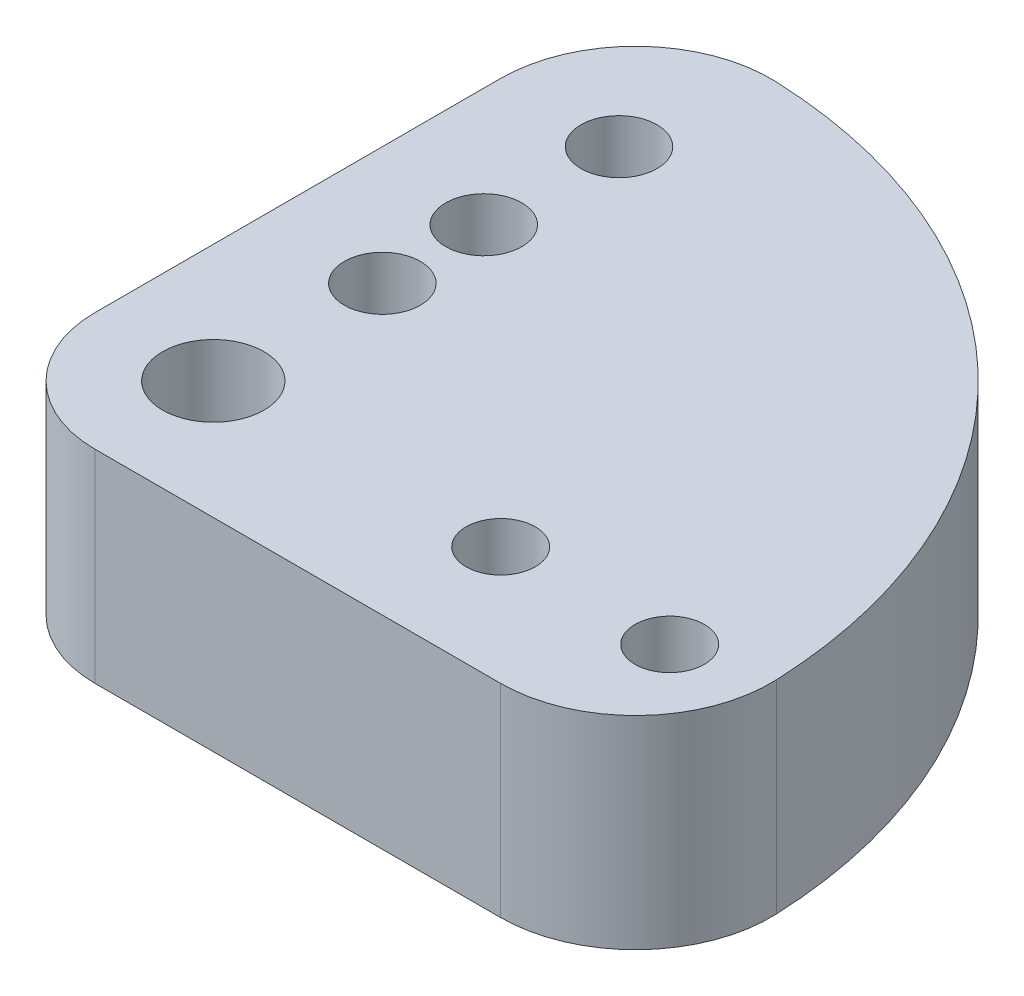
ISO-10303-21;
HEADER;
FILE_DESCRIPTION(('STEP AP214'),'2;1');
FILE_NAME('part.step','',(''),(''),'','','');
FILE_SCHEMA(('AUTOMOTIVE_DESIGN { 1 0 10303 214 1 1 1 1 }'));
ENDSEC;
DATA;
#1=APPLICATION_CONTEXT('core data for automotive mechanical design processes');
#2=APPLICATION_PROTOCOL_DEFINITION('international standard','automotive_design',2000,#1);
#3=PRODUCT_CONTEXT('',#1,'mechanical');
#4=PRODUCT('Part','Part','',(#3));
#5=PRODUCT_RELATED_PRODUCT_CATEGORY('part','',(#4));
#6=PRODUCT_DEFINITION_FORMATION('','',#4);
#7=PRODUCT_DEFINITION_CONTEXT('part definition',#1,'design');
#8=PRODUCT_DEFINITION('design','',#6,#7);
#9=PRODUCT_DEFINITION_SHAPE('','',#8);
#10=(LENGTH_UNIT() NAMED_UNIT(*) SI_UNIT(.MILLI.,.METRE.));
#11=(NAMED_UNIT(*) PLANE_ANGLE_UNIT() SI_UNIT($,.RADIAN.));
#12=(NAMED_UNIT(*) SI_UNIT($,.STERADIAN.) SOLID_ANGLE_UNIT());
#13=UNCERTAINTY_MEASURE_WITH_UNIT(LENGTH_MEASURE(1.E-05),#10,'distance_accuracy_value','');
#14=(GEOMETRIC_REPRESENTATION_CONTEXT(3) GLOBAL_UNCERTAINTY_ASSIGNED_CONTEXT((#13)) GLOBAL_UNIT_ASSIGNED_CONTEXT((#10,
#11,#12)) REPRESENTATION_CONTEXT('',''));
#15=CARTESIAN_POINT('',(0.,0.,0.));
#16=DIRECTION('',(0.,0.,1.));
#17=DIRECTION('',(1.,0.,0.));
#18=AXIS2_PLACEMENT_3D('',#15,#16,#17);
#19=CARTESIAN_POINT('',(0.,6.,0.));
#20=DIRECTION('',(0.,-1.,0.));
#21=DIRECTION('',(0.,0.,-1.));
#22=AXIS2_PLACEMENT_3D('',#19,#20,#21);
#23=CYLINDRICAL_SURFACE('',#22,1.5);
#24=CARTESIAN_POINT('',(0.,6.,0.));
#25=DIRECTION('',(0.,1.,0.));
#26=DIRECTION('',(0.,0.,1.));
#27=AXIS2_PLACEMENT_3D('',#24,#25,#26);
#28=CIRCLE('',#27,1.5);
#29=CARTESIAN_POINT('',(0.,6.,1.5));
#30=VERTEX_POINT('',#29);
#31=EDGE_CURVE('E214',#30,#30,#28,.T.);
#32=ORIENTED_EDGE('',*,*,#31,.T.);
#33=EDGE_LOOP('',(#32));
#34=FACE_BOUND('',#33,.T.);
#35=CARTESIAN_POINT('',(0.,3.,0.));
#36=DIRECTION('',(0.,-1.,0.));
#37=DIRECTION('',(0.,0.,-1.));
#38=AXIS2_PLACEMENT_3D('',#35,#36,#37);
#39=CIRCLE('',#38,1.5);
#40=CARTESIAN_POINT('',(0.,3.,-1.5));
#41=VERTEX_POINT('',#40);
#42=EDGE_CURVE('E132',#41,#41,#39,.T.);
#43=ORIENTED_EDGE('',*,*,#42,.T.);
#44=EDGE_LOOP('',(#43));
#45=FACE_BOUND('',#44,.T.);
#46=ADVANCED_FACE('F39',(#34,#45),#23,.F.);
#47=CARTESIAN_POINT('',(0.,6.,0.));
#48=DIRECTION('',(0.,1.,0.));
#49=DIRECTION('',(0.,0.,1.));
#50=AXIS2_PLACEMENT_3D('',#47,#48,#49);
#51=PLANE('',#50);
#52=CARTESIAN_POINT('',(0.,6.,-8.));
#53=DIRECTION('',(0.,1.,0.));
#54=DIRECTION('',(0.,0.,1.));
#55=AXIS2_PLACEMENT_3D('',#52,#53,#54);
#56=CIRCLE('',#55,1.125);
#57=CARTESIAN_POINT('',(0.,6.,-6.875));
#58=VERTEX_POINT('',#57);
#59=EDGE_CURVE('E205',#58,#58,#56,.T.);
#60=ORIENTED_EDGE('',*,*,#59,.F.);
#61=EDGE_LOOP('',(#60));
#62=FACE_BOUND('',#61,.T.);
#63=ORIENTED_EDGE('',*,*,#31,.F.);
#64=EDGE_LOOP('',(#63));
#65=FACE_BOUND('',#64,.T.);
#66=CARTESIAN_POINT('',(8.5,6.,0.));
#67=DIRECTION('',(0.,1.,0.));
#68=DIRECTION('',(0.,0.,1.));
#69=AXIS2_PLACEMENT_3D('',#66,#67,#68);
#70=CIRCLE('',#69,1.025);
#71=CARTESIAN_POINT('',(8.5,6.,1.025));
#72=VERTEX_POINT('',#71);
#73=EDGE_CURVE('E125',#72,#72,#70,.T.);
#74=ORIENTED_EDGE('',*,*,#73,.F.);
#75=EDGE_LOOP('',(#74));
#76=FACE_BOUND('',#75,.T.);
#77=CARTESIAN_POINT('',(0.,6.,0.));
#78=DIRECTION('',(0.,1.,0.));
#79=DIRECTION('',(0.,0.,1.));
#80=AXIS2_PLACEMENT_3D('',#77,#78,#79);
#81=CIRCLE('',#80,16.);
#82=CARTESIAN_POINT('',(15.9861050777091,6.,-0.666666666666667));
#83=VERTEX_POINT('',#82);
#84=CARTESIAN_POINT('',(0.666666666666607,6.,-15.9861050777091));
#85=VERTEX_POINT('',#84);
#86=EDGE_CURVE('E104',#83,#85,#81,.T.);
#87=ORIENTED_EDGE('',*,*,#86,.T.);
#88=CARTESIAN_POINT('',(0.499999999999955,6.,-11.9895788082818));
#89=DIRECTION('',(0.,1.,0.));
#90=DIRECTION('',(0.,0.,1.));
#91=AXIS2_PLACEMENT_3D('',#88,#89,#90);
#92=CIRCLE('',#91,4.);
#93=CARTESIAN_POINT('',(-3.50000000000005,6.,-11.9895788082818));
#94=VERTEX_POINT('',#93);
#95=EDGE_CURVE('E47',#85,#94,#92,.T.);
#96=ORIENTED_EDGE('',*,*,#95,.T.);
#97=DIRECTION('',(0.,0.,1.));
#98=VECTOR('',#97,1.);
#99=CARTESIAN_POINT('',(-3.5,6.,0.));
#100=LINE('',#99,#98);
#101=CARTESIAN_POINT('',(-3.5,6.,0.));
#102=VERTEX_POINT('',#101);
#103=EDGE_CURVE('E93',#94,#102,#100,.T.);
#104=ORIENTED_EDGE('',*,*,#103,.T.);
#105=CARTESIAN_POINT('',(0.,6.,0.));
#106=DIRECTION('',(0.,1.,0.));
#107=DIRECTION('',(0.,0.,1.));
#108=AXIS2_PLACEMENT_3D('',#105,#106,#107);
#109=CIRCLE('',#108,3.5);
#110=CARTESIAN_POINT('',(0.,6.,3.5));
#111=VERTEX_POINT('',#110);
#112=EDGE_CURVE('E98',#102,#111,#109,.T.);
#113=ORIENTED_EDGE('',*,*,#112,.T.);
#114=DIRECTION('',(1.,0.,0.));
#115=VECTOR('',#114,1.);
#116=CARTESIAN_POINT('',(0.,6.,3.5));
#117=LINE('',#116,#115);
#118=CARTESIAN_POINT('',(11.9895788082818,6.,3.5));
#119=VERTEX_POINT('',#118);
#120=EDGE_CURVE('E118',#111,#119,#117,.T.);
#121=ORIENTED_EDGE('',*,*,#120,.T.);
#122=CARTESIAN_POINT('',(11.9895788082818,6.,-0.5));
#123=DIRECTION('',(0.,1.,0.));
#124=DIRECTION('',(0.,0.,1.));
#125=AXIS2_PLACEMENT_3D('',#122,#123,#124);
#126=CIRCLE('',#125,4.);
#127=EDGE_CURVE('E146',#119,#83,#126,.T.);
#128=ORIENTED_EDGE('',*,*,#127,.T.);
#129=EDGE_LOOP('',(#87,#96,#104,#113,#121,#128));
#130=FACE_BOUND('',#129,.T.);
#131=CARTESIAN_POINT('',(13.5,6.,0.));
#132=DIRECTION('',(0.,1.,0.));
#133=DIRECTION('',(0.,0.,1.));
#134=AXIS2_PLACEMENT_3D('',#131,#132,#133);
#135=CIRCLE('',#134,1.025);
#136=CARTESIAN_POINT('',(13.5,6.,1.025));
#137=VERTEX_POINT('',#136);
#138=EDGE_CURVE('E219',#137,#137,#135,.T.);
#139=ORIENTED_EDGE('',*,*,#138,.F.);
#140=EDGE_LOOP('',(#139));
#141=FACE_BOUND('',#140,.T.);
#142=CARTESIAN_POINT('',(0.,6.,-12.));
#143=DIRECTION('',(0.,1.,0.));
#144=DIRECTION('',(0.,0.,1.));
#145=AXIS2_PLACEMENT_3D('',#142,#143,#144);
#146=CIRCLE('',#145,1.125);
#147=CARTESIAN_POINT('',(0.,6.,-10.875));
#148=VERTEX_POINT('',#147);
#149=EDGE_CURVE('E211',#148,#148,#146,.T.);
#150=ORIENTED_EDGE('',*,*,#149,.F.);
#151=EDGE_LOOP('',(#150));
#152=FACE_BOUND('',#151,.T.);
#153=CARTESIAN_POINT('',(0.,6.,-5.));
#154=DIRECTION('',(0.,1.,0.));
#155=DIRECTION('',(0.,0.,1.));
#156=AXIS2_PLACEMENT_3D('',#153,#154,#155);
#157=CIRCLE('',#156,1.125);
#158=CARTESIAN_POINT('',(0.,6.,-3.875));
#159=VERTEX_POINT('',#158);
#160=EDGE_CURVE('E199',#159,#159,#157,.T.);
#161=ORIENTED_EDGE('',*,*,#160,.F.);
#162=EDGE_LOOP('',(#161));
#163=FACE_BOUND('',#162,.T.);
#164=ADVANCED_FACE('F95',(#62,#65,#76,#130,#141,#152,#163),#51,.T.);
#165=CARTESIAN_POINT('',(0.,0.,0.));
#166=DIRECTION('',(0.,1.,0.));
#167=DIRECTION('',(0.,0.,1.));
#168=AXIS2_PLACEMENT_3D('',#165,#166,#167);
#169=PLANE('',#168);
#170=CARTESIAN_POINT('',(0.,0.,0.));
#171=DIRECTION('',(0.,-1.,0.));
#172=DIRECTION('',(0.,0.,-1.));
#173=AXIS2_PLACEMENT_3D('',#170,#171,#172);
#174=CIRCLE('',#173,2.5);
#175=CARTESIAN_POINT('',(0.,0.,-2.5));
#176=VERTEX_POINT('',#175);
#177=EDGE_CURVE('E193',#176,#176,#174,.T.);
#178=ORIENTED_EDGE('',*,*,#177,.F.);
#179=EDGE_LOOP('',(#178));
#180=FACE_BOUND('',#179,.T.);
#181=DIRECTION('',(0.,0.,1.));
#182=VECTOR('',#181,1.);
#183=CARTESIAN_POINT('',(-3.5,0.,0.));
#184=LINE('',#183,#182);
#185=CARTESIAN_POINT('',(-3.50000000000005,0.,-11.9895788082818));
#186=VERTEX_POINT('',#185);
#187=CARTESIAN_POINT('',(-3.5,0.,0.));
#188=VERTEX_POINT('',#187);
#189=EDGE_CURVE('E110',#186,#188,#184,.T.);
#190=ORIENTED_EDGE('',*,*,#189,.F.);
#191=CARTESIAN_POINT('',(0.499999999999955,0.,-11.9895788082818));
#192=DIRECTION('',(0.,1.,0.));
#193=DIRECTION('',(0.,0.,1.));
#194=AXIS2_PLACEMENT_3D('',#191,#192,#193);
#195=CIRCLE('',#194,4.);
#196=CARTESIAN_POINT('',(0.666666666666607,0.,-15.9861050777091));
#197=VERTEX_POINT('',#196);
#198=EDGE_CURVE('E140',#186,#197,#195,.F.);
#199=ORIENTED_EDGE('',*,*,#198,.T.);
#200=CARTESIAN_POINT('',(0.,0.,0.));
#201=DIRECTION('',(0.,1.,0.));
#202=DIRECTION('',(0.,0.,1.));
#203=AXIS2_PLACEMENT_3D('',#200,#201,#202);
#204=CIRCLE('',#203,16.);
#205=CARTESIAN_POINT('',(15.9861050777091,0.,-0.666666666666667));
#206=VERTEX_POINT('',#205);
#207=EDGE_CURVE('E123',#206,#197,#204,.T.);
#208=ORIENTED_EDGE('',*,*,#207,.F.);
#209=CARTESIAN_POINT('',(11.9895788082818,0.,-0.5));
#210=DIRECTION('',(0.,1.,0.));
#211=DIRECTION('',(0.,0.,1.));
#212=AXIS2_PLACEMENT_3D('',#209,#210,#211);
#213=CIRCLE('',#212,4.);
#214=CARTESIAN_POINT('',(11.9895788082818,0.,3.5));
#215=VERTEX_POINT('',#214);
#216=EDGE_CURVE('E138',#206,#215,#213,.F.);
#217=ORIENTED_EDGE('',*,*,#216,.T.);
#218=DIRECTION('',(1.,0.,0.));
#219=VECTOR('',#218,1.);
#220=CARTESIAN_POINT('',(0.,0.,3.5));
#221=LINE('',#220,#219);
#222=CARTESIAN_POINT('',(0.,0.,3.5));
#223=VERTEX_POINT('',#222);
#224=EDGE_CURVE('E129',#223,#215,#221,.T.);
#225=ORIENTED_EDGE('',*,*,#224,.F.);
#226=CARTESIAN_POINT('',(0.,0.,0.));
#227=DIRECTION('',(0.,1.,0.));
#228=DIRECTION('',(0.,0.,1.));
#229=AXIS2_PLACEMENT_3D('',#226,#227,#228);
#230=CIRCLE('',#229,3.5);
#231=EDGE_CURVE('E127',#188,#223,#230,.T.);
#232=ORIENTED_EDGE('',*,*,#231,.F.);
#233=EDGE_LOOP('',(#190,#199,#208,#217,#225,#232));
#234=FACE_BOUND('',#233,.T.);
#235=CARTESIAN_POINT('',(8.5,0.,0.));
#236=DIRECTION('',(0.,1.,0.));
#237=DIRECTION('',(0.,0.,1.));
#238=AXIS2_PLACEMENT_3D('',#235,#236,#237);
#239=CIRCLE('',#238,1.025);
#240=CARTESIAN_POINT('',(8.5,0.,1.025));
#241=VERTEX_POINT('',#240);
#242=EDGE_CURVE('E222',#241,#241,#239,.T.);
#243=ORIENTED_EDGE('',*,*,#242,.T.);
#244=EDGE_LOOP('',(#243));
#245=FACE_BOUND('',#244,.T.);
#246=CARTESIAN_POINT('',(13.5,0.,0.));
#247=DIRECTION('',(0.,1.,0.));
#248=DIRECTION('',(0.,0.,1.));
#249=AXIS2_PLACEMENT_3D('',#246,#247,#248);
#250=CIRCLE('',#249,1.025);
#251=CARTESIAN_POINT('',(13.5,0.,1.025));
#252=VERTEX_POINT('',#251);
#253=EDGE_CURVE('E218',#252,#252,#250,.T.);
#254=ORIENTED_EDGE('',*,*,#253,.T.);
#255=EDGE_LOOP('',(#254));
#256=FACE_BOUND('',#255,.T.);
#257=CARTESIAN_POINT('',(0.,0.,-12.));
#258=DIRECTION('',(0.,1.,0.));
#259=DIRECTION('',(0.,0.,1.));
#260=AXIS2_PLACEMENT_3D('',#257,#258,#259);
#261=CIRCLE('',#260,1.125);
#262=CARTESIAN_POINT('',(0.,0.,-10.875));
#263=VERTEX_POINT('',#262);
#264=EDGE_CURVE('E208',#263,#263,#261,.T.);
#265=ORIENTED_EDGE('',*,*,#264,.T.);
#266=EDGE_LOOP('',(#265));
#267=FACE_BOUND('',#266,.T.);
#268=CARTESIAN_POINT('',(0.,0.,-8.));
#269=DIRECTION('',(0.,1.,0.));
#270=DIRECTION('',(0.,0.,1.));
#271=AXIS2_PLACEMENT_3D('',#268,#269,#270);
#272=CIRCLE('',#271,1.125);
#273=CARTESIAN_POINT('',(0.,0.,-6.875));
#274=VERTEX_POINT('',#273);
#275=EDGE_CURVE('E202',#274,#274,#272,.T.);
#276=ORIENTED_EDGE('',*,*,#275,.T.);
#277=EDGE_LOOP('',(#276));
#278=FACE_BOUND('',#277,.T.);
#279=CARTESIAN_POINT('',(0.,0.,-5.));
#280=DIRECTION('',(0.,1.,0.));
#281=DIRECTION('',(0.,0.,1.));
#282=AXIS2_PLACEMENT_3D('',#279,#280,#281);
#283=CIRCLE('',#282,1.125);
#284=CARTESIAN_POINT('',(0.,0.,-3.875));
#285=VERTEX_POINT('',#284);
#286=EDGE_CURVE('E135',#285,#285,#283,.T.);
#287=ORIENTED_EDGE('',*,*,#286,.T.);
#288=EDGE_LOOP('',(#287));
#289=FACE_BOUND('',#288,.T.);
#290=ADVANCED_FACE('F154',(#180,#234,#245,#256,#267,#278,#289),#169,.F.);
#291=CARTESIAN_POINT('',(0.,6.,0.));
#292=DIRECTION('',(0.,-1.,0.));
#293=DIRECTION('',(0.,0.,-1.));
#294=AXIS2_PLACEMENT_3D('',#291,#292,#293);
#295=CYLINDRICAL_SURFACE('',#294,16.);
#296=ORIENTED_EDGE('',*,*,#207,.T.);
#297=DIRECTION('',(0.,-1.,0.));
#298=VECTOR('',#297,1.);
#299=CARTESIAN_POINT('',(0.666666666666607,6.,-15.9861050777091));
#300=LINE('',#299,#298);
#301=EDGE_CURVE('E60',#197,#85,#300,.F.);
#302=ORIENTED_EDGE('',*,*,#301,.T.);
#303=ORIENTED_EDGE('',*,*,#86,.F.);
#304=DIRECTION('',(0.,-1.,0.));
#305=VECTOR('',#304,1.);
#306=CARTESIAN_POINT('',(15.9861050777091,6.,-0.666666666666667));
#307=LINE('',#306,#305);
#308=EDGE_CURVE('E142',#83,#206,#307,.T.);
#309=ORIENTED_EDGE('',*,*,#308,.T.);
#310=EDGE_LOOP('',(#296,#302,#303,#309));
#311=FACE_BOUND('',#310,.T.);
#312=ADVANCED_FACE('F150',(#311),#295,.T.);
#313=CARTESIAN_POINT('',(-3.5,6.,0.));
#314=DIRECTION('',(1.,0.,0.));
#315=DIRECTION('',(0.,0.,-1.));
#316=AXIS2_PLACEMENT_3D('',#313,#314,#315);
#317=PLANE('',#316);
#318=ORIENTED_EDGE('',*,*,#103,.F.);
#319=DIRECTION('',(0.,-1.,0.));
#320=VECTOR('',#319,1.);
#321=CARTESIAN_POINT('',(-3.50000000000005,6.,-11.9895788082818));
#322=LINE('',#321,#320);
#323=EDGE_CURVE('E113',#94,#186,#322,.T.);
#324=ORIENTED_EDGE('',*,*,#323,.T.);
#325=ORIENTED_EDGE('',*,*,#189,.T.);
#326=DIRECTION('',(0.,-1.,0.));
#327=VECTOR('',#326,1.);
#328=CARTESIAN_POINT('',(-3.5,6.,0.));
#329=LINE('',#328,#327);
#330=EDGE_CURVE('E107',#102,#188,#329,.T.);
#331=ORIENTED_EDGE('',*,*,#330,.F.);
#332=EDGE_LOOP('',(#318,#324,#325,#331));
#333=FACE_BOUND('',#332,.T.);
#334=ADVANCED_FACE('F108',(#333),#317,.F.);
#335=CARTESIAN_POINT('',(0.,6.,0.));
#336=DIRECTION('',(0.,-1.,0.));
#337=DIRECTION('',(0.,0.,-1.));
#338=AXIS2_PLACEMENT_3D('',#335,#336,#337);
#339=CYLINDRICAL_SURFACE('',#338,3.5);
#340=ORIENTED_EDGE('',*,*,#231,.T.);
#341=DIRECTION('',(0.,-1.,0.));
#342=VECTOR('',#341,1.);
#343=CARTESIAN_POINT('',(0.,6.,3.5));
#344=LINE('',#343,#342);
#345=EDGE_CURVE('E114',#111,#223,#344,.T.);
#346=ORIENTED_EDGE('',*,*,#345,.F.);
#347=ORIENTED_EDGE('',*,*,#112,.F.);
#348=ORIENTED_EDGE('',*,*,#330,.T.);
#349=EDGE_LOOP('',(#340,#346,#347,#348));
#350=FACE_BOUND('',#349,.T.);
#351=ADVANCED_FACE('F116',(#350),#339,.T.);
#352=CARTESIAN_POINT('',(0.,6.,3.5));
#353=DIRECTION('',(0.,0.,-1.));
#354=DIRECTION('',(-1.,0.,0.));
#355=AXIS2_PLACEMENT_3D('',#352,#353,#354);
#356=PLANE('',#355);
#357=ORIENTED_EDGE('',*,*,#224,.T.);
#358=DIRECTION('',(0.,-1.,0.));
#359=VECTOR('',#358,1.);
#360=CARTESIAN_POINT('',(11.9895788082818,6.,3.5));
#361=LINE('',#360,#359);
#362=EDGE_CURVE('E11',#215,#119,#361,.F.);
#363=ORIENTED_EDGE('',*,*,#362,.T.);
#364=ORIENTED_EDGE('',*,*,#120,.F.);
#365=ORIENTED_EDGE('',*,*,#345,.T.);
#366=EDGE_LOOP('',(#357,#363,#364,#365));
#367=FACE_BOUND('',#366,.T.);
#368=ADVANCED_FACE('F156',(#367),#356,.F.);
#369=CARTESIAN_POINT('',(8.5,6.,0.));
#370=DIRECTION('',(0.,-1.,0.));
#371=DIRECTION('',(0.,0.,-1.));
#372=AXIS2_PLACEMENT_3D('',#369,#370,#371);
#373=CYLINDRICAL_SURFACE('',#372,1.025);
#374=ORIENTED_EDGE('',*,*,#73,.T.);
#375=EDGE_LOOP('',(#374));
#376=FACE_BOUND('',#375,.T.);
#377=ORIENTED_EDGE('',*,*,#242,.F.);
#378=EDGE_LOOP('',(#377));
#379=FACE_BOUND('',#378,.T.);
#380=ADVANCED_FACE('F158',(#376,#379),#373,.F.);
#381=CARTESIAN_POINT('',(13.5,6.,0.));
#382=DIRECTION('',(0.,-1.,0.));
#383=DIRECTION('',(0.,0.,-1.));
#384=AXIS2_PLACEMENT_3D('',#381,#382,#383);
#385=CYLINDRICAL_SURFACE('',#384,1.025);
#386=ORIENTED_EDGE('',*,*,#138,.T.);
#387=EDGE_LOOP('',(#386));
#388=FACE_BOUND('',#387,.T.);
#389=ORIENTED_EDGE('',*,*,#253,.F.);
#390=EDGE_LOOP('',(#389));
#391=FACE_BOUND('',#390,.T.);
#392=ADVANCED_FACE('F164',(#388,#391),#385,.F.);
#393=CARTESIAN_POINT('',(0.,6.,-12.));
#394=DIRECTION('',(0.,-1.,0.));
#395=DIRECTION('',(0.,0.,-1.));
#396=AXIS2_PLACEMENT_3D('',#393,#394,#395);
#397=CYLINDRICAL_SURFACE('',#396,1.125);
#398=ORIENTED_EDGE('',*,*,#149,.T.);
#399=EDGE_LOOP('',(#398));
#400=FACE_BOUND('',#399,.T.);
#401=ORIENTED_EDGE('',*,*,#264,.F.);
#402=EDGE_LOOP('',(#401));
#403=FACE_BOUND('',#402,.T.);
#404=ADVANCED_FACE('F181',(#400,#403),#397,.F.);
#405=CARTESIAN_POINT('',(0.,6.,-8.));
#406=DIRECTION('',(0.,-1.,0.));
#407=DIRECTION('',(0.,0.,-1.));
#408=AXIS2_PLACEMENT_3D('',#405,#406,#407);
#409=CYLINDRICAL_SURFACE('',#408,1.125);
#410=ORIENTED_EDGE('',*,*,#59,.T.);
#411=EDGE_LOOP('',(#410));
#412=FACE_BOUND('',#411,.T.);
#413=ORIENTED_EDGE('',*,*,#275,.F.);
#414=EDGE_LOOP('',(#413));
#415=FACE_BOUND('',#414,.T.);
#416=ADVANCED_FACE('F242',(#412,#415),#409,.F.);
#417=CARTESIAN_POINT('',(0.,6.,-5.));
#418=DIRECTION('',(0.,-1.,0.));
#419=DIRECTION('',(0.,0.,-1.));
#420=AXIS2_PLACEMENT_3D('',#417,#418,#419);
#421=CYLINDRICAL_SURFACE('',#420,1.125);
#422=ORIENTED_EDGE('',*,*,#160,.T.);
#423=EDGE_LOOP('',(#422));
#424=FACE_BOUND('',#423,.T.);
#425=ORIENTED_EDGE('',*,*,#286,.F.);
#426=EDGE_LOOP('',(#425));
#427=FACE_BOUND('',#426,.T.);
#428=ADVANCED_FACE('F239',(#424,#427),#421,.F.);
#429=CARTESIAN_POINT('',(0.,3.,0.));
#430=DIRECTION('',(0.,-1.,0.));
#431=DIRECTION('',(0.,0.,-1.));
#432=AXIS2_PLACEMENT_3D('',#429,#430,#431);
#433=CYLINDRICAL_SURFACE('',#432,2.5);
#434=CARTESIAN_POINT('',(0.,3.,0.));
#435=DIRECTION('',(0.,-1.,0.));
#436=DIRECTION('',(0.,0.,-1.));
#437=AXIS2_PLACEMENT_3D('',#434,#435,#436);
#438=CIRCLE('',#437,2.5);
#439=CARTESIAN_POINT('',(0.,3.,-2.5));
#440=VERTEX_POINT('',#439);
#441=EDGE_CURVE('E136',#440,#440,#438,.T.);
#442=ORIENTED_EDGE('',*,*,#441,.F.);
#443=EDGE_LOOP('',(#442));
#444=FACE_BOUND('',#443,.T.);
#445=ORIENTED_EDGE('',*,*,#177,.T.);
#446=EDGE_LOOP('',(#445));
#447=FACE_BOUND('',#446,.T.);
#448=ADVANCED_FACE('F241',(#444,#447),#433,.F.);
#449=CARTESIAN_POINT('',(0.,3.,0.));
#450=DIRECTION('',(0.,-1.,0.));
#451=DIRECTION('',(0.,0.,-1.));
#452=AXIS2_PLACEMENT_3D('',#449,#450,#451);
#453=PLANE('',#452);
#454=ORIENTED_EDGE('',*,*,#42,.F.);
#455=EDGE_LOOP('',(#454));
#456=FACE_BOUND('',#455,.T.);
#457=ORIENTED_EDGE('',*,*,#441,.T.);
#458=EDGE_LOOP('',(#457));
#459=FACE_BOUND('',#458,.T.);
#460=ADVANCED_FACE('F249',(#456,#459),#453,.T.);
#461=CARTESIAN_POINT('',(0.499999999999955,6.,-11.9895788082818));
#462=DIRECTION('',(0.,-1.,0.));
#463=DIRECTION('',(0.,0.,-1.));
#464=AXIS2_PLACEMENT_3D('',#461,#462,#463);
#465=CYLINDRICAL_SURFACE('',#464,4.);
#466=ORIENTED_EDGE('',*,*,#95,.F.);
#467=ORIENTED_EDGE('',*,*,#301,.F.);
#468=ORIENTED_EDGE('',*,*,#198,.F.);
#469=ORIENTED_EDGE('',*,*,#323,.F.);
#470=EDGE_LOOP('',(#466,#467,#468,#469));
#471=FACE_BOUND('',#470,.T.);
#472=ADVANCED_FACE('F255',(#471),#465,.T.);
#473=CARTESIAN_POINT('',(11.9895788082818,6.,-0.5));
#474=DIRECTION('',(0.,-1.,0.));
#475=DIRECTION('',(0.,0.,-1.));
#476=AXIS2_PLACEMENT_3D('',#473,#474,#475);
#477=CYLINDRICAL_SURFACE('',#476,4.);
#478=ORIENTED_EDGE('',*,*,#127,.F.);
#479=ORIENTED_EDGE('',*,*,#362,.F.);
#480=ORIENTED_EDGE('',*,*,#216,.F.);
#481=ORIENTED_EDGE('',*,*,#308,.F.);
#482=EDGE_LOOP('',(#478,#479,#480,#481));
#483=FACE_BOUND('',#482,.T.);
#484=ADVANCED_FACE('F41',(#483),#477,.T.);
#485=CLOSED_SHELL('',(#46,#164,#290,#312,#334,#351,#368,#380,#392,#404,#416,#428,#448,#460,#472,#484));
#486=MANIFOLD_SOLID_BREP('B2',#485);
#487=ADVANCED_BREP_SHAPE_REPRESENTATION('',(#18,#486),#14);
#488=SHAPE_DEFINITION_REPRESENTATION(#9,#487);
ENDSEC;
END-ISO-10303-21;
